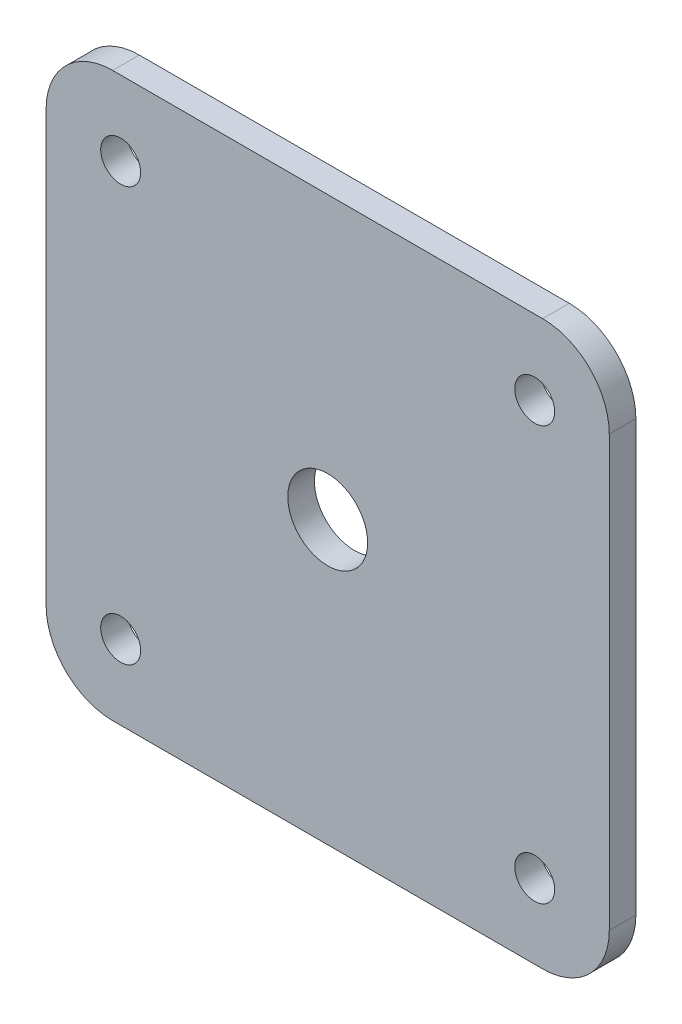
ISO-10303-21;
HEADER;
FILE_DESCRIPTION(('STEP AP214'),'2;1');
FILE_NAME('part.step','',(''),(''),'','','');
FILE_SCHEMA(('AUTOMOTIVE_DESIGN { 1 0 10303 214 1 1 1 1 }'));
ENDSEC;
DATA;
#1=APPLICATION_CONTEXT('core data for automotive mechanical design processes');
#2=APPLICATION_PROTOCOL_DEFINITION('international standard','automotive_design',2000,#1);
#3=PRODUCT_CONTEXT('',#1,'mechanical');
#4=PRODUCT('Part','Part','',(#3));
#5=PRODUCT_RELATED_PRODUCT_CATEGORY('part','',(#4));
#6=PRODUCT_DEFINITION_FORMATION('','',#4);
#7=PRODUCT_DEFINITION_CONTEXT('part definition',#1,'design');
#8=PRODUCT_DEFINITION('design','',#6,#7);
#9=PRODUCT_DEFINITION_SHAPE('','',#8);
#10=(LENGTH_UNIT() NAMED_UNIT(*) SI_UNIT(.MILLI.,.METRE.));
#11=(NAMED_UNIT(*) PLANE_ANGLE_UNIT() SI_UNIT($,.RADIAN.));
#12=(NAMED_UNIT(*) SI_UNIT($,.STERADIAN.) SOLID_ANGLE_UNIT());
#13=UNCERTAINTY_MEASURE_WITH_UNIT(LENGTH_MEASURE(1.E-05),#10,'distance_accuracy_value','');
#14=(GEOMETRIC_REPRESENTATION_CONTEXT(3) GLOBAL_UNCERTAINTY_ASSIGNED_CONTEXT((#13)) GLOBAL_UNIT_ASSIGNED_CONTEXT((#10,
#11,#12)) REPRESENTATION_CONTEXT('',''));
#15=CARTESIAN_POINT('',(0.,0.,0.));
#16=DIRECTION('',(0.,0.,1.));
#17=DIRECTION('',(1.,0.,0.));
#18=AXIS2_PLACEMENT_3D('',#15,#16,#17);
#19=CARTESIAN_POINT('',(16.15,16.15,2.));
#20=DIRECTION('',(0.,0.,-1.));
#21=DIRECTION('',(-1.,0.,0.));
#22=AXIS2_PLACEMENT_3D('',#19,#20,#21);
#23=PLANE('',#22);
#24=CARTESIAN_POINT('',(-15.55,-15.55,2.));
#25=DIRECTION('',(0.,0.,1.));
#26=DIRECTION('',(1.,0.,0.));
#27=AXIS2_PLACEMENT_3D('',#24,#25,#26);
#28=CIRCLE('',#27,1.5);
#29=CARTESIAN_POINT('',(-14.05,-15.55,2.));
#30=VERTEX_POINT('',#29);
#31=EDGE_CURVE('E196',#30,#30,#28,.T.);
#32=ORIENTED_EDGE('',*,*,#31,.F.);
#33=EDGE_LOOP('',(#32));
#34=FACE_BOUND('',#33,.T.);
#35=CARTESIAN_POINT('',(15.55,15.55,2.));
#36=DIRECTION('',(0.,0.,1.));
#37=DIRECTION('',(1.,0.,0.));
#38=AXIS2_PLACEMENT_3D('',#35,#36,#37);
#39=CIRCLE('',#38,1.5);
#40=CARTESIAN_POINT('',(17.05,15.55,2.));
#41=VERTEX_POINT('',#40);
#42=EDGE_CURVE('E184',#41,#41,#39,.T.);
#43=ORIENTED_EDGE('',*,*,#42,.F.);
#44=EDGE_LOOP('',(#43));
#45=FACE_BOUND('',#44,.T.);
#46=CARTESIAN_POINT('',(16.15,16.15,2.));
#47=DIRECTION('',(0.,0.,1.));
#48=DIRECTION('',(-1.,0.,0.));
#49=AXIS2_PLACEMENT_3D('',#46,#47,#48);
#50=CIRCLE('',#49,5.);
#51=CARTESIAN_POINT('',(21.15,16.15,2.));
#52=VERTEX_POINT('',#51);
#53=CARTESIAN_POINT('',(16.15,21.15,2.));
#54=VERTEX_POINT('',#53);
#55=EDGE_CURVE('E147',#52,#54,#50,.T.);
#56=ORIENTED_EDGE('',*,*,#55,.T.);
#57=DIRECTION('',(-1.,0.,0.));
#58=VECTOR('',#57,1.);
#59=CARTESIAN_POINT('',(-16.15,21.15,2.));
#60=LINE('',#59,#58);
#61=CARTESIAN_POINT('',(-16.15,21.15,2.));
#62=VERTEX_POINT('',#61);
#63=EDGE_CURVE('E95',#54,#62,#60,.T.);
#64=ORIENTED_EDGE('',*,*,#63,.T.);
#65=CARTESIAN_POINT('',(-16.15,16.15,2.));
#66=DIRECTION('',(0.,0.,1.));
#67=DIRECTION('',(-1.,0.,0.));
#68=AXIS2_PLACEMENT_3D('',#65,#66,#67);
#69=CIRCLE('',#68,5.);
#70=CARTESIAN_POINT('',(-21.15,16.15,2.));
#71=VERTEX_POINT('',#70);
#72=EDGE_CURVE('E162',#62,#71,#69,.T.);
#73=ORIENTED_EDGE('',*,*,#72,.T.);
#74=DIRECTION('',(0.,-1.,0.));
#75=VECTOR('',#74,1.);
#76=CARTESIAN_POINT('',(-21.15,-16.15,2.));
#77=LINE('',#76,#75);
#78=CARTESIAN_POINT('',(-21.15,-16.15,2.));
#79=VERTEX_POINT('',#78);
#80=EDGE_CURVE('E175',#71,#79,#77,.T.);
#81=ORIENTED_EDGE('',*,*,#80,.T.);
#82=CARTESIAN_POINT('',(-16.15,-16.15,2.));
#83=DIRECTION('',(0.,0.,1.));
#84=DIRECTION('',(1.,0.,0.));
#85=AXIS2_PLACEMENT_3D('',#82,#83,#84);
#86=CIRCLE('',#85,5.);
#87=CARTESIAN_POINT('',(-16.15,-21.15,2.));
#88=VERTEX_POINT('',#87);
#89=EDGE_CURVE('E114',#79,#88,#86,.T.);
#90=ORIENTED_EDGE('',*,*,#89,.T.);
#91=DIRECTION('',(1.,0.,0.));
#92=VECTOR('',#91,1.);
#93=CARTESIAN_POINT('',(-16.15,-21.15,2.));
#94=LINE('',#93,#92);
#95=CARTESIAN_POINT('',(16.15,-21.15,2.));
#96=VERTEX_POINT('',#95);
#97=EDGE_CURVE('E108',#88,#96,#94,.T.);
#98=ORIENTED_EDGE('',*,*,#97,.T.);
#99=CARTESIAN_POINT('',(16.15,-16.15,2.));
#100=DIRECTION('',(0.,0.,1.));
#101=DIRECTION('',(1.,0.,0.));
#102=AXIS2_PLACEMENT_3D('',#99,#100,#101);
#103=CIRCLE('',#102,5.);
#104=CARTESIAN_POINT('',(21.15,-16.15,2.));
#105=VERTEX_POINT('',#104);
#106=EDGE_CURVE('E112',#96,#105,#103,.T.);
#107=ORIENTED_EDGE('',*,*,#106,.T.);
#108=DIRECTION('',(0.,1.,0.));
#109=VECTOR('',#108,1.);
#110=CARTESIAN_POINT('',(21.15,-16.15,2.));
#111=LINE('',#110,#109);
#112=EDGE_CURVE('E52',#105,#52,#111,.T.);
#113=ORIENTED_EDGE('',*,*,#112,.T.);
#114=EDGE_LOOP('',(#56,#64,#73,#81,#90,#98,#107,#113));
#115=FACE_BOUND('',#114,.T.);
#116=CARTESIAN_POINT('',(-15.55,15.55,2.));
#117=DIRECTION('',(0.,0.,1.));
#118=DIRECTION('',(1.,0.,0.));
#119=AXIS2_PLACEMENT_3D('',#116,#117,#118);
#120=CIRCLE('',#119,1.5);
#121=CARTESIAN_POINT('',(-14.05,15.55,2.));
#122=VERTEX_POINT('',#121);
#123=EDGE_CURVE('E136',#122,#122,#120,.T.);
#124=ORIENTED_EDGE('',*,*,#123,.F.);
#125=EDGE_LOOP('',(#124));
#126=FACE_BOUND('',#125,.T.);
#127=CARTESIAN_POINT('',(15.55,-15.55,2.));
#128=DIRECTION('',(0.,0.,1.));
#129=DIRECTION('',(1.,0.,0.));
#130=AXIS2_PLACEMENT_3D('',#127,#128,#129);
#131=CIRCLE('',#130,1.5);
#132=CARTESIAN_POINT('',(17.05,-15.55,2.));
#133=VERTEX_POINT('',#132);
#134=EDGE_CURVE('E190',#133,#133,#131,.T.);
#135=ORIENTED_EDGE('',*,*,#134,.F.);
#136=EDGE_LOOP('',(#135));
#137=FACE_BOUND('',#136,.T.);
#138=CARTESIAN_POINT('',(0.,0.,2.));
#139=DIRECTION('',(0.,0.,1.));
#140=DIRECTION('',(1.,0.,0.));
#141=AXIS2_PLACEMENT_3D('',#138,#139,#140);
#142=CIRCLE('',#141,3.);
#143=CARTESIAN_POINT('',(3.,0.,2.));
#144=VERTEX_POINT('',#143);
#145=EDGE_CURVE('E202',#144,#144,#142,.T.);
#146=ORIENTED_EDGE('',*,*,#145,.F.);
#147=EDGE_LOOP('',(#146));
#148=FACE_BOUND('',#147,.T.);
#149=ADVANCED_FACE('F35',(#34,#45,#115,#126,#137,#148),#23,.F.);
#150=CARTESIAN_POINT('',(16.15,16.15,0.));
#151=DIRECTION('',(0.,0.,-1.));
#152=DIRECTION('',(-1.,0.,0.));
#153=AXIS2_PLACEMENT_3D('',#150,#151,#152);
#154=PLANE('',#153);
#155=CARTESIAN_POINT('',(-15.55,-15.55,0.));
#156=DIRECTION('',(0.,0.,1.));
#157=DIRECTION('',(1.,0.,0.));
#158=AXIS2_PLACEMENT_3D('',#155,#156,#157);
#159=CIRCLE('',#158,1.5);
#160=CARTESIAN_POINT('',(-14.05,-15.55,0.));
#161=VERTEX_POINT('',#160);
#162=EDGE_CURVE('E199',#161,#161,#159,.T.);
#163=ORIENTED_EDGE('',*,*,#162,.T.);
#164=EDGE_LOOP('',(#163));
#165=FACE_BOUND('',#164,.T.);
#166=CARTESIAN_POINT('',(15.55,15.55,0.));
#167=DIRECTION('',(0.,0.,1.));
#168=DIRECTION('',(1.,0.,0.));
#169=AXIS2_PLACEMENT_3D('',#166,#167,#168);
#170=CIRCLE('',#169,1.5);
#171=CARTESIAN_POINT('',(17.05,15.55,0.));
#172=VERTEX_POINT('',#171);
#173=EDGE_CURVE('E187',#172,#172,#170,.T.);
#174=ORIENTED_EDGE('',*,*,#173,.T.);
#175=EDGE_LOOP('',(#174));
#176=FACE_BOUND('',#175,.T.);
#177=CARTESIAN_POINT('',(16.15,16.15,0.));
#178=DIRECTION('',(0.,0.,1.));
#179=DIRECTION('',(-1.,0.,0.));
#180=AXIS2_PLACEMENT_3D('',#177,#178,#179);
#181=CIRCLE('',#180,5.);
#182=CARTESIAN_POINT('',(21.15,16.15,0.));
#183=VERTEX_POINT('',#182);
#184=CARTESIAN_POINT('',(16.15,21.15,0.));
#185=VERTEX_POINT('',#184);
#186=EDGE_CURVE('E132',#183,#185,#181,.T.);
#187=ORIENTED_EDGE('',*,*,#186,.F.);
#188=DIRECTION('',(0.,1.,0.));
#189=VECTOR('',#188,1.);
#190=CARTESIAN_POINT('',(21.15,-16.15,0.));
#191=LINE('',#190,#189);
#192=CARTESIAN_POINT('',(21.15,-16.15,0.));
#193=VERTEX_POINT('',#192);
#194=EDGE_CURVE('E87',#193,#183,#191,.T.);
#195=ORIENTED_EDGE('',*,*,#194,.F.);
#196=CARTESIAN_POINT('',(16.15,-16.15,0.));
#197=DIRECTION('',(0.,0.,1.));
#198=DIRECTION('',(1.,0.,0.));
#199=AXIS2_PLACEMENT_3D('',#196,#197,#198);
#200=CIRCLE('',#199,5.);
#201=CARTESIAN_POINT('',(16.15,-21.15,0.));
#202=VERTEX_POINT('',#201);
#203=EDGE_CURVE('E81',#202,#193,#200,.T.);
#204=ORIENTED_EDGE('',*,*,#203,.F.);
#205=DIRECTION('',(1.,0.,0.));
#206=VECTOR('',#205,1.);
#207=CARTESIAN_POINT('',(-16.15,-21.15,0.));
#208=LINE('',#207,#206);
#209=CARTESIAN_POINT('',(-16.15,-21.15,0.));
#210=VERTEX_POINT('',#209);
#211=EDGE_CURVE('E122',#210,#202,#208,.T.);
#212=ORIENTED_EDGE('',*,*,#211,.F.);
#213=CARTESIAN_POINT('',(-16.15,-16.15,0.));
#214=DIRECTION('',(0.,0.,1.));
#215=DIRECTION('',(1.,0.,0.));
#216=AXIS2_PLACEMENT_3D('',#213,#214,#215);
#217=CIRCLE('',#216,5.);
#218=CARTESIAN_POINT('',(-21.15,-16.15,0.));
#219=VERTEX_POINT('',#218);
#220=EDGE_CURVE('E142',#219,#210,#217,.T.);
#221=ORIENTED_EDGE('',*,*,#220,.F.);
#222=DIRECTION('',(0.,-1.,0.));
#223=VECTOR('',#222,1.);
#224=CARTESIAN_POINT('',(-21.15,-16.15,0.));
#225=LINE('',#224,#223);
#226=CARTESIAN_POINT('',(-21.15,16.15,0.));
#227=VERTEX_POINT('',#226);
#228=EDGE_CURVE('E140',#227,#219,#225,.T.);
#229=ORIENTED_EDGE('',*,*,#228,.F.);
#230=CARTESIAN_POINT('',(-16.15,16.15,0.));
#231=DIRECTION('',(0.,0.,1.));
#232=DIRECTION('',(-1.,0.,0.));
#233=AXIS2_PLACEMENT_3D('',#230,#231,#232);
#234=CIRCLE('',#233,5.);
#235=CARTESIAN_POINT('',(-16.15,21.15,0.));
#236=VERTEX_POINT('',#235);
#237=EDGE_CURVE('E138',#236,#227,#234,.T.);
#238=ORIENTED_EDGE('',*,*,#237,.F.);
#239=DIRECTION('',(-1.,0.,0.));
#240=VECTOR('',#239,1.);
#241=CARTESIAN_POINT('',(-16.15,21.15,0.));
#242=LINE('',#241,#240);
#243=EDGE_CURVE('E135',#185,#236,#242,.T.);
#244=ORIENTED_EDGE('',*,*,#243,.F.);
#245=EDGE_LOOP('',(#187,#195,#204,#212,#221,#229,#238,#244));
#246=FACE_BOUND('',#245,.T.);
#247=CARTESIAN_POINT('',(-15.55,15.55,0.));
#248=DIRECTION('',(0.,0.,1.));
#249=DIRECTION('',(1.,0.,0.));
#250=AXIS2_PLACEMENT_3D('',#247,#248,#249);
#251=CIRCLE('',#250,1.5);
#252=CARTESIAN_POINT('',(-14.05,15.55,0.));
#253=VERTEX_POINT('',#252);
#254=EDGE_CURVE('E181',#253,#253,#251,.T.);
#255=ORIENTED_EDGE('',*,*,#254,.T.);
#256=EDGE_LOOP('',(#255));
#257=FACE_BOUND('',#256,.T.);
#258=CARTESIAN_POINT('',(15.55,-15.55,0.));
#259=DIRECTION('',(0.,0.,1.));
#260=DIRECTION('',(1.,0.,0.));
#261=AXIS2_PLACEMENT_3D('',#258,#259,#260);
#262=CIRCLE('',#261,1.5);
#263=CARTESIAN_POINT('',(17.05,-15.55,0.));
#264=VERTEX_POINT('',#263);
#265=EDGE_CURVE('E193',#264,#264,#262,.T.);
#266=ORIENTED_EDGE('',*,*,#265,.T.);
#267=EDGE_LOOP('',(#266));
#268=FACE_BOUND('',#267,.T.);
#269=CARTESIAN_POINT('',(0.,0.,0.));
#270=DIRECTION('',(0.,0.,1.));
#271=DIRECTION('',(1.,0.,0.));
#272=AXIS2_PLACEMENT_3D('',#269,#270,#271);
#273=CIRCLE('',#272,3.);
#274=CARTESIAN_POINT('',(3.,0.,0.));
#275=VERTEX_POINT('',#274);
#276=EDGE_CURVE('E205',#275,#275,#273,.T.);
#277=ORIENTED_EDGE('',*,*,#276,.T.);
#278=EDGE_LOOP('',(#277));
#279=FACE_BOUND('',#278,.T.);
#280=ADVANCED_FACE('F166',(#165,#176,#246,#257,#268,#279),#154,.T.);
#281=CARTESIAN_POINT('',(16.15,16.15,2.));
#282=DIRECTION('',(0.,0.,-1.));
#283=DIRECTION('',(-1.,0.,0.));
#284=AXIS2_PLACEMENT_3D('',#281,#282,#283);
#285=CYLINDRICAL_SURFACE('',#284,5.);
#286=ORIENTED_EDGE('',*,*,#186,.T.);
#287=DIRECTION('',(0.,0.,-1.));
#288=VECTOR('',#287,1.);
#289=CARTESIAN_POINT('',(16.15,21.15,2.));
#290=LINE('',#289,#288);
#291=EDGE_CURVE('E11',#54,#185,#290,.T.);
#292=ORIENTED_EDGE('',*,*,#291,.F.);
#293=ORIENTED_EDGE('',*,*,#55,.F.);
#294=DIRECTION('',(0.,0.,-1.));
#295=VECTOR('',#294,1.);
#296=CARTESIAN_POINT('',(21.15,16.15,2.));
#297=LINE('',#296,#295);
#298=EDGE_CURVE('E128',#52,#183,#297,.T.);
#299=ORIENTED_EDGE('',*,*,#298,.T.);
#300=EDGE_LOOP('',(#286,#292,#293,#299));
#301=FACE_BOUND('',#300,.T.);
#302=ADVANCED_FACE('F37',(#301),#285,.T.);
#303=CARTESIAN_POINT('',(-16.15,21.15,2.));
#304=DIRECTION('',(0.,-1.,0.));
#305=DIRECTION('',(0.,0.,-1.));
#306=AXIS2_PLACEMENT_3D('',#303,#304,#305);
#307=PLANE('',#306);
#308=ORIENTED_EDGE('',*,*,#243,.T.);
#309=DIRECTION('',(0.,0.,-1.));
#310=VECTOR('',#309,1.);
#311=CARTESIAN_POINT('',(-16.15,21.15,2.));
#312=LINE('',#311,#310);
#313=EDGE_CURVE('E44',#62,#236,#312,.T.);
#314=ORIENTED_EDGE('',*,*,#313,.F.);
#315=ORIENTED_EDGE('',*,*,#63,.F.);
#316=ORIENTED_EDGE('',*,*,#291,.T.);
#317=EDGE_LOOP('',(#308,#314,#315,#316));
#318=FACE_BOUND('',#317,.T.);
#319=ADVANCED_FACE('F240',(#318),#307,.F.);
#320=CARTESIAN_POINT('',(-16.15,16.15,2.));
#321=DIRECTION('',(0.,0.,-1.));
#322=DIRECTION('',(-1.,0.,0.));
#323=AXIS2_PLACEMENT_3D('',#320,#321,#322);
#324=CYLINDRICAL_SURFACE('',#323,5.);
#325=ORIENTED_EDGE('',*,*,#237,.T.);
#326=DIRECTION('',(0.,0.,-1.));
#327=VECTOR('',#326,1.);
#328=CARTESIAN_POINT('',(-21.15,16.15,2.));
#329=LINE('',#328,#327);
#330=EDGE_CURVE('E154',#71,#227,#329,.T.);
#331=ORIENTED_EDGE('',*,*,#330,.F.);
#332=ORIENTED_EDGE('',*,*,#72,.F.);
#333=ORIENTED_EDGE('',*,*,#313,.T.);
#334=EDGE_LOOP('',(#325,#331,#332,#333));
#335=FACE_BOUND('',#334,.T.);
#336=ADVANCED_FACE('F160',(#335),#324,.T.);
#337=CARTESIAN_POINT('',(-21.15,-16.15,2.));
#338=DIRECTION('',(1.,0.,0.));
#339=DIRECTION('',(0.,0.,-1.));
#340=AXIS2_PLACEMENT_3D('',#337,#338,#339);
#341=PLANE('',#340);
#342=ORIENTED_EDGE('',*,*,#228,.T.);
#343=DIRECTION('',(0.,0.,-1.));
#344=VECTOR('',#343,1.);
#345=CARTESIAN_POINT('',(-21.15,-16.15,2.));
#346=LINE('',#345,#344);
#347=EDGE_CURVE('E151',#79,#219,#346,.T.);
#348=ORIENTED_EDGE('',*,*,#347,.F.);
#349=ORIENTED_EDGE('',*,*,#80,.F.);
#350=ORIENTED_EDGE('',*,*,#330,.T.);
#351=EDGE_LOOP('',(#342,#348,#349,#350));
#352=FACE_BOUND('',#351,.T.);
#353=ADVANCED_FACE('F171',(#352),#341,.F.);
#354=CARTESIAN_POINT('',(-16.15,-16.15,2.));
#355=DIRECTION('',(0.,0.,-1.));
#356=DIRECTION('',(-1.,0.,0.));
#357=AXIS2_PLACEMENT_3D('',#354,#355,#356);
#358=CYLINDRICAL_SURFACE('',#357,5.);
#359=ORIENTED_EDGE('',*,*,#220,.T.);
#360=DIRECTION('',(0.,0.,-1.));
#361=VECTOR('',#360,1.);
#362=CARTESIAN_POINT('',(-16.15,-21.15,2.));
#363=LINE('',#362,#361);
#364=EDGE_CURVE('E123',#88,#210,#363,.T.);
#365=ORIENTED_EDGE('',*,*,#364,.F.);
#366=ORIENTED_EDGE('',*,*,#89,.F.);
#367=ORIENTED_EDGE('',*,*,#347,.T.);
#368=EDGE_LOOP('',(#359,#365,#366,#367));
#369=FACE_BOUND('',#368,.T.);
#370=ADVANCED_FACE('F174',(#369),#358,.T.);
#371=CARTESIAN_POINT('',(-16.15,-21.15,2.));
#372=DIRECTION('',(0.,1.,0.));
#373=DIRECTION('',(-1.,0.,0.));
#374=AXIS2_PLACEMENT_3D('',#371,#372,#373);
#375=PLANE('',#374);
#376=ORIENTED_EDGE('',*,*,#211,.T.);
#377=DIRECTION('',(0.,0.,-1.));
#378=VECTOR('',#377,1.);
#379=CARTESIAN_POINT('',(16.15,-21.15,2.));
#380=LINE('',#379,#378);
#381=EDGE_CURVE('E119',#96,#202,#380,.T.);
#382=ORIENTED_EDGE('',*,*,#381,.F.);
#383=ORIENTED_EDGE('',*,*,#97,.F.);
#384=ORIENTED_EDGE('',*,*,#364,.T.);
#385=EDGE_LOOP('',(#376,#382,#383,#384));
#386=FACE_BOUND('',#385,.T.);
#387=ADVANCED_FACE('F120',(#386),#375,.F.);
#388=CARTESIAN_POINT('',(16.15,-16.15,2.));
#389=DIRECTION('',(0.,0.,-1.));
#390=DIRECTION('',(-1.,0.,0.));
#391=AXIS2_PLACEMENT_3D('',#388,#389,#390);
#392=CYLINDRICAL_SURFACE('',#391,5.);
#393=ORIENTED_EDGE('',*,*,#203,.T.);
#394=DIRECTION('',(0.,0.,-1.));
#395=VECTOR('',#394,1.);
#396=CARTESIAN_POINT('',(21.15,-16.15,2.));
#397=LINE('',#396,#395);
#398=EDGE_CURVE('E124',#105,#193,#397,.T.);
#399=ORIENTED_EDGE('',*,*,#398,.F.);
#400=ORIENTED_EDGE('',*,*,#106,.F.);
#401=ORIENTED_EDGE('',*,*,#381,.T.);
#402=EDGE_LOOP('',(#393,#399,#400,#401));
#403=FACE_BOUND('',#402,.T.);
#404=ADVANCED_FACE('F126',(#403),#392,.T.);
#405=CARTESIAN_POINT('',(21.15,-16.15,2.));
#406=DIRECTION('',(-1.,0.,0.));
#407=DIRECTION('',(0.,0.,1.));
#408=AXIS2_PLACEMENT_3D('',#405,#406,#407);
#409=PLANE('',#408);
#410=ORIENTED_EDGE('',*,*,#194,.T.);
#411=ORIENTED_EDGE('',*,*,#298,.F.);
#412=ORIENTED_EDGE('',*,*,#112,.F.);
#413=ORIENTED_EDGE('',*,*,#398,.T.);
#414=EDGE_LOOP('',(#410,#411,#412,#413));
#415=FACE_BOUND('',#414,.T.);
#416=ADVANCED_FACE('F228',(#415),#409,.F.);
#417=CARTESIAN_POINT('',(-15.55,15.55,2.));
#418=DIRECTION('',(0.,0.,-1.));
#419=DIRECTION('',(-1.,0.,0.));
#420=AXIS2_PLACEMENT_3D('',#417,#418,#419);
#421=CYLINDRICAL_SURFACE('',#420,1.5);
#422=ORIENTED_EDGE('',*,*,#123,.T.);
#423=EDGE_LOOP('',(#422));
#424=FACE_BOUND('',#423,.T.);
#425=ORIENTED_EDGE('',*,*,#254,.F.);
#426=EDGE_LOOP('',(#425));
#427=FACE_BOUND('',#426,.T.);
#428=ADVANCED_FACE('F225',(#424,#427),#421,.F.);
#429=CARTESIAN_POINT('',(15.55,15.55,2.));
#430=DIRECTION('',(0.,0.,-1.));
#431=DIRECTION('',(-1.,0.,0.));
#432=AXIS2_PLACEMENT_3D('',#429,#430,#431);
#433=CYLINDRICAL_SURFACE('',#432,1.5);
#434=ORIENTED_EDGE('',*,*,#42,.T.);
#435=EDGE_LOOP('',(#434));
#436=FACE_BOUND('',#435,.T.);
#437=ORIENTED_EDGE('',*,*,#173,.F.);
#438=EDGE_LOOP('',(#437));
#439=FACE_BOUND('',#438,.T.);
#440=ADVANCED_FACE('F304',(#436,#439),#433,.F.);
#441=CARTESIAN_POINT('',(15.55,-15.55,2.));
#442=DIRECTION('',(0.,0.,-1.));
#443=DIRECTION('',(-1.,0.,0.));
#444=AXIS2_PLACEMENT_3D('',#441,#442,#443);
#445=CYLINDRICAL_SURFACE('',#444,1.5);
#446=ORIENTED_EDGE('',*,*,#134,.T.);
#447=EDGE_LOOP('',(#446));
#448=FACE_BOUND('',#447,.T.);
#449=ORIENTED_EDGE('',*,*,#265,.F.);
#450=EDGE_LOOP('',(#449));
#451=FACE_BOUND('',#450,.T.);
#452=ADVANCED_FACE('F312',(#448,#451),#445,.F.);
#453=CARTESIAN_POINT('',(-15.55,-15.55,2.));
#454=DIRECTION('',(0.,0.,-1.));
#455=DIRECTION('',(-1.,0.,0.));
#456=AXIS2_PLACEMENT_3D('',#453,#454,#455);
#457=CYLINDRICAL_SURFACE('',#456,1.5);
#458=ORIENTED_EDGE('',*,*,#31,.T.);
#459=EDGE_LOOP('',(#458));
#460=FACE_BOUND('',#459,.T.);
#461=ORIENTED_EDGE('',*,*,#162,.F.);
#462=EDGE_LOOP('',(#461));
#463=FACE_BOUND('',#462,.T.);
#464=ADVANCED_FACE('F320',(#460,#463),#457,.F.);
#465=CARTESIAN_POINT('',(0.,0.,2.));
#466=DIRECTION('',(0.,0.,-1.));
#467=DIRECTION('',(-1.,0.,0.));
#468=AXIS2_PLACEMENT_3D('',#465,#466,#467);
#469=CYLINDRICAL_SURFACE('',#468,3.);
#470=ORIENTED_EDGE('',*,*,#145,.T.);
#471=EDGE_LOOP('',(#470));
#472=FACE_BOUND('',#471,.T.);
#473=ORIENTED_EDGE('',*,*,#276,.F.);
#474=EDGE_LOOP('',(#473));
#475=FACE_BOUND('',#474,.T.);
#476=ADVANCED_FACE('F211',(#472,#475),#469,.F.);
#477=CLOSED_SHELL('',(#149,#280,#302,#319,#336,#353,#370,#387,#404,#416,#428,#440,#452,#464,#476));
#478=MANIFOLD_SOLID_BREP('B2',#477);
#479=ADVANCED_BREP_SHAPE_REPRESENTATION('',(#18,#478),#14);
#480=SHAPE_DEFINITION_REPRESENTATION(#9,#479);
ENDSEC;
END-ISO-10303-21;
